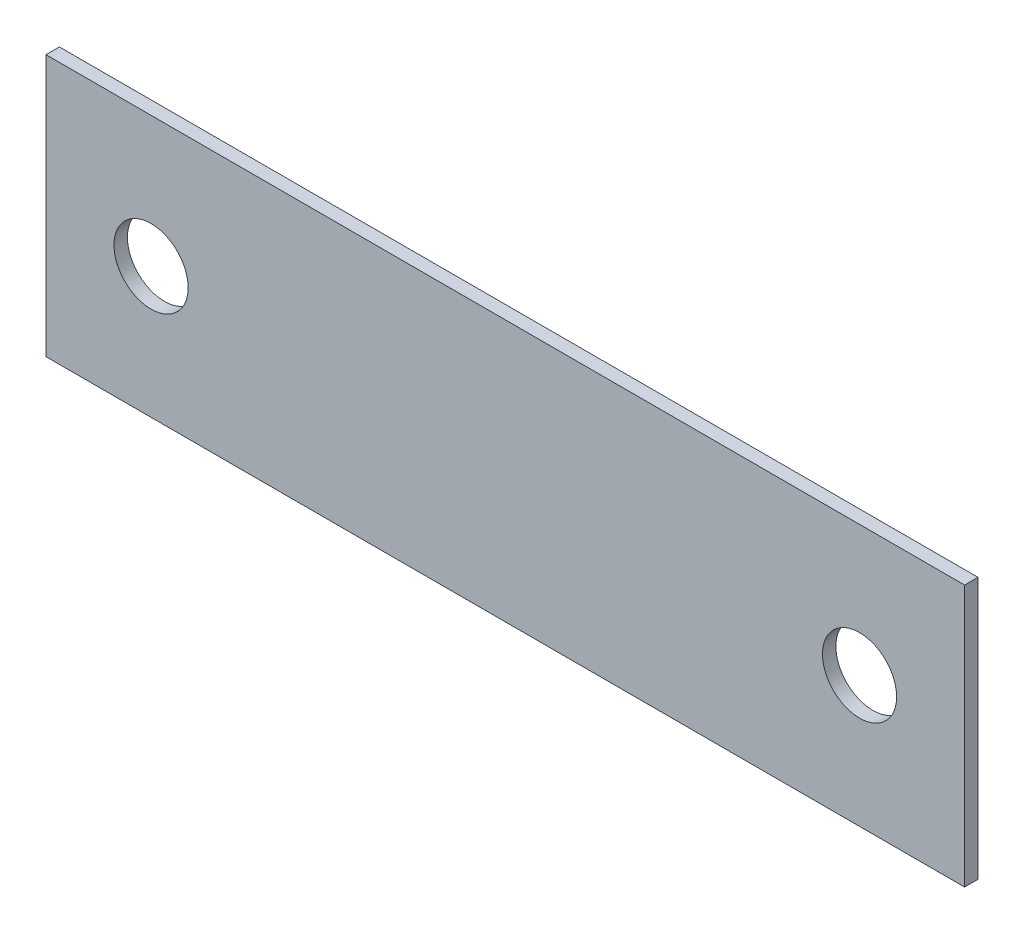
ISO-10303-21;
HEADER;
FILE_DESCRIPTION(('STEP AP214'),'2;1');
FILE_NAME('part.step','',(''),(''),'','','');
FILE_SCHEMA(('AUTOMOTIVE_DESIGN { 1 0 10303 214 1 1 1 1 }'));
ENDSEC;
DATA;
#1=APPLICATION_CONTEXT('core data for automotive mechanical design processes');
#2=APPLICATION_PROTOCOL_DEFINITION('international standard','automotive_design',2000,#1);
#3=PRODUCT_CONTEXT('',#1,'mechanical');
#4=PRODUCT('Part','Part','',(#3));
#5=PRODUCT_RELATED_PRODUCT_CATEGORY('part','',(#4));
#6=PRODUCT_DEFINITION_FORMATION('','',#4);
#7=PRODUCT_DEFINITION_CONTEXT('part definition',#1,'design');
#8=PRODUCT_DEFINITION('design','',#6,#7);
#9=PRODUCT_DEFINITION_SHAPE('','',#8);
#10=(LENGTH_UNIT() NAMED_UNIT(*) SI_UNIT(.MILLI.,.METRE.));
#11=(NAMED_UNIT(*) PLANE_ANGLE_UNIT() SI_UNIT($,.RADIAN.));
#12=(NAMED_UNIT(*) SI_UNIT($,.STERADIAN.) SOLID_ANGLE_UNIT());
#13=UNCERTAINTY_MEASURE_WITH_UNIT(LENGTH_MEASURE(1.E-05),#10,'distance_accuracy_value','');
#14=(GEOMETRIC_REPRESENTATION_CONTEXT(3) GLOBAL_UNCERTAINTY_ASSIGNED_CONTEXT((#13)) GLOBAL_UNIT_ASSIGNED_CONTEXT((#10,
#11,#12)) REPRESENTATION_CONTEXT('',''));
#15=CARTESIAN_POINT('',(0.,0.,0.));
#16=DIRECTION('',(0.,0.,1.));
#17=DIRECTION('',(1.,0.,0.));
#18=AXIS2_PLACEMENT_3D('',#15,#16,#17);
#19=CARTESIAN_POINT('',(-30.5784775413711,16.9367860520094,0.8128));
#20=DIRECTION('',(1.,0.,0.));
#21=DIRECTION('',(0.,0.,-1.));
#22=AXIS2_PLACEMENT_3D('',#19,#20,#21);
#23=PLANE('',#22);
#24=DIRECTION('',(0.,-1.,0.));
#25=VECTOR('',#24,1.);
#26=CARTESIAN_POINT('',(-30.5784775413711,16.9367860520094,0.));
#27=LINE('',#26,#25);
#28=CARTESIAN_POINT('',(-30.5784775413711,16.9367860520094,0.));
#29=VERTEX_POINT('',#28);
#30=CARTESIAN_POINT('',(-30.5784775413711,1.06178605200945,0.));
#31=VERTEX_POINT('',#30);
#32=EDGE_CURVE('E96',#29,#31,#27,.T.);
#33=ORIENTED_EDGE('',*,*,#32,.T.);
#34=DIRECTION('',(0.,0.,-1.));
#35=VECTOR('',#34,1.);
#36=CARTESIAN_POINT('',(-30.5784775413711,1.06178605200945,0.8128));
#37=LINE('',#36,#35);
#38=CARTESIAN_POINT('',(-30.5784775413711,1.06178605200945,0.8128));
#39=VERTEX_POINT('',#38);
#40=EDGE_CURVE('E11',#39,#31,#37,.T.);
#41=ORIENTED_EDGE('',*,*,#40,.F.);
#42=DIRECTION('',(0.,-1.,0.));
#43=VECTOR('',#42,1.);
#44=CARTESIAN_POINT('',(-30.5784775413711,16.9367860520094,0.8128));
#45=LINE('',#44,#43);
#46=CARTESIAN_POINT('',(-30.5784775413711,16.9367860520094,0.8128));
#47=VERTEX_POINT('',#46);
#48=EDGE_CURVE('E84',#47,#39,#45,.T.);
#49=ORIENTED_EDGE('',*,*,#48,.F.);
#50=DIRECTION('',(0.,0.,-1.));
#51=VECTOR('',#50,1.);
#52=CARTESIAN_POINT('',(-30.5784775413711,16.9367860520094,0.8128));
#53=LINE('',#52,#51);
#54=EDGE_CURVE('E92',#47,#29,#53,.T.);
#55=ORIENTED_EDGE('',*,*,#54,.T.);
#56=EDGE_LOOP('',(#33,#41,#49,#55));
#57=FACE_BOUND('',#56,.T.);
#58=ADVANCED_FACE('F33',(#57),#23,.F.);
#59=CARTESIAN_POINT('',(-30.5784775413711,1.06178605200945,0.8128));
#60=DIRECTION('',(0.,1.,0.));
#61=DIRECTION('',(0.,0.,1.));
#62=AXIS2_PLACEMENT_3D('',#59,#60,#61);
#63=PLANE('',#62);
#64=DIRECTION('',(1.,0.,0.));
#65=VECTOR('',#64,1.);
#66=CARTESIAN_POINT('',(-30.5784775413711,1.06178605200945,0.));
#67=LINE('',#66,#65);
#68=CARTESIAN_POINT('',(25.1745224586289,1.06178605200945,0.));
#69=VERTEX_POINT('',#68);
#70=EDGE_CURVE('E88',#31,#69,#67,.T.);
#71=ORIENTED_EDGE('',*,*,#70,.T.);
#72=DIRECTION('',(0.,0.,-1.));
#73=VECTOR('',#72,1.);
#74=CARTESIAN_POINT('',(25.1745224586289,1.06178605200945,0.8128));
#75=LINE('',#74,#73);
#76=CARTESIAN_POINT('',(25.1745224586289,1.06178605200945,0.8128));
#77=VERTEX_POINT('',#76);
#78=EDGE_CURVE('E41',#77,#69,#75,.T.);
#79=ORIENTED_EDGE('',*,*,#78,.F.);
#80=DIRECTION('',(1.,0.,0.));
#81=VECTOR('',#80,1.);
#82=CARTESIAN_POINT('',(-30.5784775413711,1.06178605200945,0.8128));
#83=LINE('',#82,#81);
#84=EDGE_CURVE('E79',#39,#77,#83,.T.);
#85=ORIENTED_EDGE('',*,*,#84,.F.);
#86=ORIENTED_EDGE('',*,*,#40,.T.);
#87=EDGE_LOOP('',(#71,#79,#85,#86));
#88=FACE_BOUND('',#87,.T.);
#89=ADVANCED_FACE('F87',(#88),#63,.F.);
#90=CARTESIAN_POINT('',(25.1745224586289,16.9367860520094,0.8128));
#91=DIRECTION('',(-1.,0.,0.));
#92=DIRECTION('',(0.,-1.,0.));
#93=AXIS2_PLACEMENT_3D('',#90,#91,#92);
#94=PLANE('',#93);
#95=DIRECTION('',(0.,1.,0.));
#96=VECTOR('',#95,1.);
#97=CARTESIAN_POINT('',(25.1745224586289,16.9367860520094,0.));
#98=LINE('',#97,#96);
#99=CARTESIAN_POINT('',(25.1745224586289,16.9367860520094,0.));
#100=VERTEX_POINT('',#99);
#101=EDGE_CURVE('E66',#69,#100,#98,.T.);
#102=ORIENTED_EDGE('',*,*,#101,.T.);
#103=DIRECTION('',(0.,0.,-1.));
#104=VECTOR('',#103,1.);
#105=CARTESIAN_POINT('',(25.1745224586289,16.9367860520094,0.8128));
#106=LINE('',#105,#104);
#107=CARTESIAN_POINT('',(25.1745224586289,16.9367860520094,0.8128));
#108=VERTEX_POINT('',#107);
#109=EDGE_CURVE('E89',#108,#100,#106,.T.);
#110=ORIENTED_EDGE('',*,*,#109,.F.);
#111=DIRECTION('',(0.,1.,0.));
#112=VECTOR('',#111,1.);
#113=CARTESIAN_POINT('',(25.1745224586289,16.9367860520094,0.8128));
#114=LINE('',#113,#112);
#115=EDGE_CURVE('E82',#77,#108,#114,.T.);
#116=ORIENTED_EDGE('',*,*,#115,.F.);
#117=ORIENTED_EDGE('',*,*,#78,.T.);
#118=EDGE_LOOP('',(#102,#110,#116,#117));
#119=FACE_BOUND('',#118,.T.);
#120=ADVANCED_FACE('F90',(#119),#94,.F.);
#121=CARTESIAN_POINT('',(-30.5784775413711,16.9367860520094,0.8128));
#122=DIRECTION('',(0.,-1.,0.));
#123=DIRECTION('',(0.,0.,-1.));
#124=AXIS2_PLACEMENT_3D('',#121,#122,#123);
#125=PLANE('',#124);
#126=DIRECTION('',(-1.,0.,0.));
#127=VECTOR('',#126,1.);
#128=CARTESIAN_POINT('',(-30.5784775413711,16.9367860520094,0.));
#129=LINE('',#128,#127);
#130=EDGE_CURVE('E72',#100,#29,#129,.T.);
#131=ORIENTED_EDGE('',*,*,#130,.T.);
#132=ORIENTED_EDGE('',*,*,#54,.F.);
#133=DIRECTION('',(-1.,0.,0.));
#134=VECTOR('',#133,1.);
#135=CARTESIAN_POINT('',(-30.5784775413711,16.9367860520094,0.8128));
#136=LINE('',#135,#134);
#137=EDGE_CURVE('E49',#108,#47,#136,.T.);
#138=ORIENTED_EDGE('',*,*,#137,.F.);
#139=ORIENTED_EDGE('',*,*,#109,.T.);
#140=EDGE_LOOP('',(#131,#132,#138,#139));
#141=FACE_BOUND('',#140,.T.);
#142=ADVANCED_FACE('F104',(#141),#125,.F.);
#143=CARTESIAN_POINT('',(0.,0.,0.8128));
#144=DIRECTION('',(0.,0.,1.));
#145=DIRECTION('',(1.,0.,0.));
#146=AXIS2_PLACEMENT_3D('',#143,#144,#145);
#147=PLANE('',#146);
#148=CARTESIAN_POINT('',(-24.2018075413711,8.99928605200945,0.8128));
#149=DIRECTION('',(0.,0.,1.));
#150=DIRECTION('',(1.,0.,0.));
#151=AXIS2_PLACEMENT_3D('',#148,#149,#150);
#152=CIRCLE('',#151,2.25);
#153=CARTESIAN_POINT('',(-21.9518075413711,8.99928605200945,0.8128));
#154=VERTEX_POINT('',#153);
#155=EDGE_CURVE('E118',#154,#154,#152,.T.);
#156=ORIENTED_EDGE('',*,*,#155,.F.);
#157=EDGE_LOOP('',(#156));
#158=FACE_BOUND('',#157,.T.);
#159=CARTESIAN_POINT('',(18.7978524586289,8.99928605200945,0.8128));
#160=DIRECTION('',(0.,0.,1.));
#161=DIRECTION('',(1.,0.,0.));
#162=AXIS2_PLACEMENT_3D('',#159,#160,#161);
#163=CIRCLE('',#162,2.25);
#164=CARTESIAN_POINT('',(21.0478524586289,8.99928605200945,0.8128));
#165=VERTEX_POINT('',#164);
#166=EDGE_CURVE('E112',#165,#165,#163,.T.);
#167=ORIENTED_EDGE('',*,*,#166,.F.);
#168=EDGE_LOOP('',(#167));
#169=FACE_BOUND('',#168,.T.);
#170=ORIENTED_EDGE('',*,*,#48,.T.);
#171=ORIENTED_EDGE('',*,*,#84,.T.);
#172=ORIENTED_EDGE('',*,*,#115,.T.);
#173=ORIENTED_EDGE('',*,*,#137,.T.);
#174=EDGE_LOOP('',(#170,#171,#172,#173));
#175=FACE_BOUND('',#174,.T.);
#176=ADVANCED_FACE('F80',(#158,#169,#175),#147,.T.);
#177=CARTESIAN_POINT('',(0.,0.,0.));
#178=DIRECTION('',(0.,0.,1.));
#179=DIRECTION('',(1.,0.,0.));
#180=AXIS2_PLACEMENT_3D('',#177,#178,#179);
#181=PLANE('',#180);
#182=CARTESIAN_POINT('',(-24.2018075413711,8.99928605200945,0.));
#183=DIRECTION('',(0.,0.,1.));
#184=DIRECTION('',(1.,0.,0.));
#185=AXIS2_PLACEMENT_3D('',#182,#183,#184);
#186=CIRCLE('',#185,2.25);
#187=CARTESIAN_POINT('',(-21.9518075413711,8.99928605200945,0.));
#188=VERTEX_POINT('',#187);
#189=EDGE_CURVE('E115',#188,#188,#186,.T.);
#190=ORIENTED_EDGE('',*,*,#189,.T.);
#191=EDGE_LOOP('',(#190));
#192=FACE_BOUND('',#191,.T.);
#193=CARTESIAN_POINT('',(18.7978524586289,8.99928605200945,0.));
#194=DIRECTION('',(0.,0.,1.));
#195=DIRECTION('',(1.,0.,0.));
#196=AXIS2_PLACEMENT_3D('',#193,#194,#195);
#197=CIRCLE('',#196,2.25);
#198=CARTESIAN_POINT('',(21.0478524586289,8.99928605200945,0.));
#199=VERTEX_POINT('',#198);
#200=EDGE_CURVE('E99',#199,#199,#197,.T.);
#201=ORIENTED_EDGE('',*,*,#200,.T.);
#202=EDGE_LOOP('',(#201));
#203=FACE_BOUND('',#202,.T.);
#204=ORIENTED_EDGE('',*,*,#32,.F.);
#205=ORIENTED_EDGE('',*,*,#130,.F.);
#206=ORIENTED_EDGE('',*,*,#101,.F.);
#207=ORIENTED_EDGE('',*,*,#70,.F.);
#208=EDGE_LOOP('',(#204,#205,#206,#207));
#209=FACE_BOUND('',#208,.T.);
#210=ADVANCED_FACE('F107',(#192,#203,#209),#181,.F.);
#211=CARTESIAN_POINT('',(18.7978524586289,8.99928605200945,0.8128));
#212=DIRECTION('',(0.,0.,1.));
#213=DIRECTION('',(1.,0.,0.));
#214=AXIS2_PLACEMENT_3D('',#211,#212,#213);
#215=CYLINDRICAL_SURFACE('',#214,2.25);
#216=ORIENTED_EDGE('',*,*,#200,.F.);
#217=EDGE_LOOP('',(#216));
#218=FACE_BOUND('',#217,.T.);
#219=ORIENTED_EDGE('',*,*,#166,.T.);
#220=EDGE_LOOP('',(#219));
#221=FACE_BOUND('',#220,.T.);
#222=ADVANCED_FACE('F129',(#218,#221),#215,.F.);
#223=CARTESIAN_POINT('',(-24.2018075413711,8.99928605200945,0.8128));
#224=DIRECTION('',(0.,0.,1.));
#225=DIRECTION('',(1.,0.,0.));
#226=AXIS2_PLACEMENT_3D('',#223,#224,#225);
#227=CYLINDRICAL_SURFACE('',#226,2.25);
#228=ORIENTED_EDGE('',*,*,#189,.F.);
#229=EDGE_LOOP('',(#228));
#230=FACE_BOUND('',#229,.T.);
#231=ORIENTED_EDGE('',*,*,#155,.T.);
#232=EDGE_LOOP('',(#231));
#233=FACE_BOUND('',#232,.T.);
#234=ADVANCED_FACE('F122',(#230,#233),#227,.F.);
#235=CLOSED_SHELL('',(#58,#89,#120,#142,#176,#210,#222,#234));
#236=MANIFOLD_SOLID_BREP('B2',#235);
#237=ADVANCED_BREP_SHAPE_REPRESENTATION('',(#18,#236),#14);
#238=SHAPE_DEFINITION_REPRESENTATION(#9,#237);
ENDSEC;
END-ISO-10303-21;
